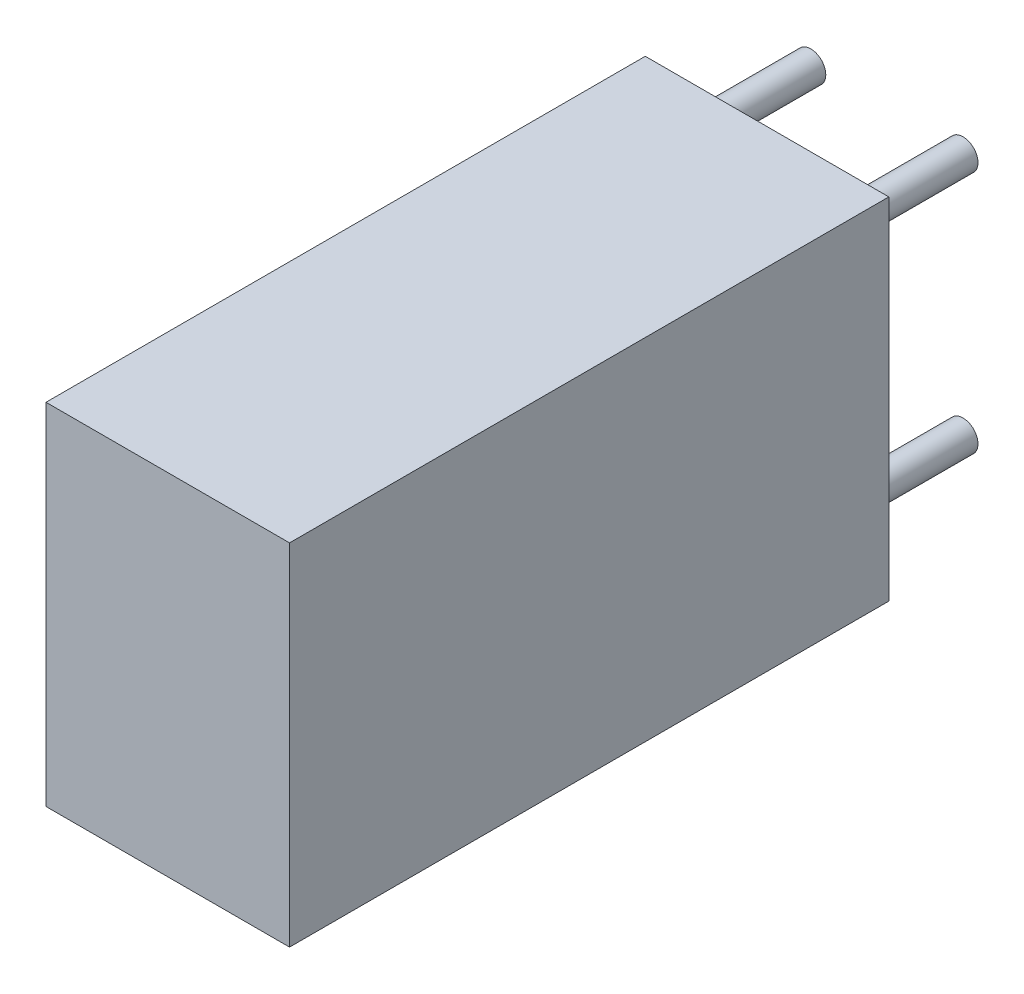
ISO-10303-21;
HEADER;
FILE_DESCRIPTION(('STEP AP214'),'2;1');
FILE_NAME('part.step','',(''),(''),'','','');
FILE_SCHEMA(('AUTOMOTIVE_DESIGN { 1 0 10303 214 1 1 1 1 }'));
ENDSEC;
DATA;
#1=APPLICATION_CONTEXT('core data for automotive mechanical design processes');
#2=APPLICATION_PROTOCOL_DEFINITION('international standard','automotive_design',2000,#1);
#3=PRODUCT_CONTEXT('',#1,'mechanical');
#4=PRODUCT('Part','Part','',(#3));
#5=PRODUCT_RELATED_PRODUCT_CATEGORY('part','',(#4));
#6=PRODUCT_DEFINITION_FORMATION('','',#4);
#7=PRODUCT_DEFINITION_CONTEXT('part definition',#1,'design');
#8=PRODUCT_DEFINITION('design','',#6,#7);
#9=PRODUCT_DEFINITION_SHAPE('','',#8);
#10=(LENGTH_UNIT() NAMED_UNIT(*) SI_UNIT(.MILLI.,.METRE.));
#11=(NAMED_UNIT(*) PLANE_ANGLE_UNIT() SI_UNIT($,.RADIAN.));
#12=(NAMED_UNIT(*) SI_UNIT($,.STERADIAN.) SOLID_ANGLE_UNIT());
#13=UNCERTAINTY_MEASURE_WITH_UNIT(LENGTH_MEASURE(1.E-05),#10,'distance_accuracy_value','');
#14=(GEOMETRIC_REPRESENTATION_CONTEXT(3) GLOBAL_UNCERTAINTY_ASSIGNED_CONTEXT((#13)) GLOBAL_UNIT_ASSIGNED_CONTEXT((#10,
#11,#12)) REPRESENTATION_CONTEXT('',''));
#15=CARTESIAN_POINT('',(0.,0.,0.));
#16=DIRECTION('',(0.,0.,1.));
#17=DIRECTION('',(1.,0.,0.));
#18=AXIS2_PLACEMENT_3D('',#15,#16,#17);
#19=CARTESIAN_POINT('',(0.,0.,-2.));
#20=DIRECTION('',(0.,0.,1.));
#21=DIRECTION('',(1.,0.,0.));
#22=AXIS2_PLACEMENT_3D('',#19,#20,#21);
#23=CYLINDRICAL_SURFACE('',#22,0.25);
#24=CARTESIAN_POINT('',(0.,0.,-2.));
#25=DIRECTION('',(0.,0.,1.));
#26=DIRECTION('',(1.,0.,0.));
#27=AXIS2_PLACEMENT_3D('',#24,#25,#26);
#28=CIRCLE('',#27,0.25);
#29=CARTESIAN_POINT('',(0.25,0.,-2.));
#30=VERTEX_POINT('',#29);
#31=EDGE_CURVE('E11',#30,#30,#28,.T.);
#32=ORIENTED_EDGE('',*,*,#31,.T.);
#33=EDGE_LOOP('',(#32));
#34=FACE_BOUND('',#33,.T.);
#35=CARTESIAN_POINT('',(0.,0.,0.));
#36=DIRECTION('',(0.,0.,1.));
#37=DIRECTION('',(1.,0.,0.));
#38=AXIS2_PLACEMENT_3D('',#35,#36,#37);
#39=CIRCLE('',#38,0.25);
#40=CARTESIAN_POINT('',(0.25,0.,0.));
#41=VERTEX_POINT('',#40);
#42=EDGE_CURVE('E43',#41,#41,#39,.T.);
#43=ORIENTED_EDGE('',*,*,#42,.F.);
#44=EDGE_LOOP('',(#43));
#45=FACE_BOUND('',#44,.T.);
#46=ADVANCED_FACE('F40',(#34,#45),#23,.T.);
#47=CARTESIAN_POINT('',(0.,0.,-2.));
#48=DIRECTION('',(0.,0.,1.));
#49=DIRECTION('',(1.,0.,0.));
#50=AXIS2_PLACEMENT_3D('',#47,#48,#49);
#51=PLANE('',#50);
#52=ORIENTED_EDGE('',*,*,#31,.F.);
#53=EDGE_LOOP('',(#52));
#54=FACE_BOUND('',#53,.T.);
#55=ADVANCED_FACE('F55',(#54),#51,.F.);
#56=CARTESIAN_POINT('',(0.,0.,0.));
#57=DIRECTION('',(0.,0.,1.));
#58=DIRECTION('',(1.,0.,0.));
#59=AXIS2_PLACEMENT_3D('',#56,#57,#58);
#60=PLANE('',#59);
#61=ORIENTED_EDGE('',*,*,#42,.T.);
#62=EDGE_LOOP('',(#61));
#63=FACE_BOUND('',#62,.T.);
#64=ADVANCED_FACE('F52',(#63),#60,.T.);
#65=CLOSED_SHELL('',(#46,#55,#64));
#66=MANIFOLD_SOLID_BREP('B2',#65);
#67=CARTESIAN_POINT('',(2.54,0.,-2.));
#68=DIRECTION('',(0.,0.,1.));
#69=DIRECTION('',(1.,0.,0.));
#70=AXIS2_PLACEMENT_3D('',#67,#68,#69);
#71=CYLINDRICAL_SURFACE('',#70,0.25);
#72=CARTESIAN_POINT('',(2.54,0.,-2.));
#73=DIRECTION('',(0.,0.,1.));
#74=DIRECTION('',(1.,0.,0.));
#75=AXIS2_PLACEMENT_3D('',#72,#73,#74);
#76=CIRCLE('',#75,0.25);
#77=CARTESIAN_POINT('',(2.79,0.,-2.));
#78=VERTEX_POINT('',#77);
#79=EDGE_CURVE('E39',#78,#78,#76,.T.);
#80=ORIENTED_EDGE('',*,*,#79,.T.);
#81=EDGE_LOOP('',(#80));
#82=FACE_BOUND('',#81,.T.);
#83=CARTESIAN_POINT('',(2.54,0.,0.));
#84=DIRECTION('',(0.,0.,1.));
#85=DIRECTION('',(1.,0.,0.));
#86=AXIS2_PLACEMENT_3D('',#83,#84,#85);
#87=CIRCLE('',#86,0.25);
#88=CARTESIAN_POINT('',(2.79,0.,0.));
#89=VERTEX_POINT('',#88);
#90=EDGE_CURVE('E92',#89,#89,#87,.T.);
#91=ORIENTED_EDGE('',*,*,#90,.F.);
#92=EDGE_LOOP('',(#91));
#93=FACE_BOUND('',#92,.T.);
#94=ADVANCED_FACE('F89',(#82,#93),#71,.T.);
#95=CARTESIAN_POINT('',(2.54,0.,-2.));
#96=DIRECTION('',(0.,0.,1.));
#97=DIRECTION('',(1.,0.,0.));
#98=AXIS2_PLACEMENT_3D('',#95,#96,#97);
#99=PLANE('',#98);
#100=ORIENTED_EDGE('',*,*,#79,.F.);
#101=EDGE_LOOP('',(#100));
#102=FACE_BOUND('',#101,.T.);
#103=ADVANCED_FACE('F104',(#102),#99,.F.);
#104=CARTESIAN_POINT('',(2.54,0.,0.));
#105=DIRECTION('',(0.,0.,1.));
#106=DIRECTION('',(1.,0.,0.));
#107=AXIS2_PLACEMENT_3D('',#104,#105,#106);
#108=PLANE('',#107);
#109=ORIENTED_EDGE('',*,*,#90,.T.);
#110=EDGE_LOOP('',(#109));
#111=FACE_BOUND('',#110,.T.);
#112=ADVANCED_FACE('F101',(#111),#108,.T.);
#113=CLOSED_SHELL('',(#94,#103,#112));
#114=MANIFOLD_SOLID_BREP('B6',#113);
#115=CARTESIAN_POINT('',(2.54,4.064,-2.));
#116=DIRECTION('',(0.,0.,1.));
#117=DIRECTION('',(1.,0.,0.));
#118=AXIS2_PLACEMENT_3D('',#115,#116,#117);
#119=CYLINDRICAL_SURFACE('',#118,0.25);
#120=CARTESIAN_POINT('',(2.54,4.064,-2.));
#121=DIRECTION('',(0.,0.,1.));
#122=DIRECTION('',(1.,0.,0.));
#123=AXIS2_PLACEMENT_3D('',#120,#121,#122);
#124=CIRCLE('',#123,0.25);
#125=CARTESIAN_POINT('',(2.79,4.064,-2.));
#126=VERTEX_POINT('',#125);
#127=EDGE_CURVE('E88',#126,#126,#124,.T.);
#128=ORIENTED_EDGE('',*,*,#127,.T.);
#129=EDGE_LOOP('',(#128));
#130=FACE_BOUND('',#129,.T.);
#131=CARTESIAN_POINT('',(2.54,4.064,0.));
#132=DIRECTION('',(0.,0.,1.));
#133=DIRECTION('',(1.,0.,0.));
#134=AXIS2_PLACEMENT_3D('',#131,#132,#133);
#135=CIRCLE('',#134,0.25);
#136=CARTESIAN_POINT('',(2.79,4.064,0.));
#137=VERTEX_POINT('',#136);
#138=EDGE_CURVE('E141',#137,#137,#135,.T.);
#139=ORIENTED_EDGE('',*,*,#138,.F.);
#140=EDGE_LOOP('',(#139));
#141=FACE_BOUND('',#140,.T.);
#142=ADVANCED_FACE('F138',(#130,#141),#119,.T.);
#143=CARTESIAN_POINT('',(2.54,4.064,-2.));
#144=DIRECTION('',(0.,0.,1.));
#145=DIRECTION('',(1.,0.,0.));
#146=AXIS2_PLACEMENT_3D('',#143,#144,#145);
#147=PLANE('',#146);
#148=ORIENTED_EDGE('',*,*,#127,.F.);
#149=EDGE_LOOP('',(#148));
#150=FACE_BOUND('',#149,.T.);
#151=ADVANCED_FACE('F153',(#150),#147,.F.);
#152=CARTESIAN_POINT('',(2.54,4.064,0.));
#153=DIRECTION('',(0.,0.,1.));
#154=DIRECTION('',(1.,0.,0.));
#155=AXIS2_PLACEMENT_3D('',#152,#153,#154);
#156=PLANE('',#155);
#157=ORIENTED_EDGE('',*,*,#138,.T.);
#158=EDGE_LOOP('',(#157));
#159=FACE_BOUND('',#158,.T.);
#160=ADVANCED_FACE('F150',(#159),#156,.T.);
#161=CLOSED_SHELL('',(#142,#151,#160));
#162=MANIFOLD_SOLID_BREP('B34',#161);
#163=CARTESIAN_POINT('',(0.,4.064,-2.));
#164=DIRECTION('',(0.,0.,1.));
#165=DIRECTION('',(1.,0.,0.));
#166=AXIS2_PLACEMENT_3D('',#163,#164,#165);
#167=CYLINDRICAL_SURFACE('',#166,0.25);
#168=CARTESIAN_POINT('',(0.,4.064,-2.));
#169=DIRECTION('',(0.,0.,1.));
#170=DIRECTION('',(1.,0.,0.));
#171=AXIS2_PLACEMENT_3D('',#168,#169,#170);
#172=CIRCLE('',#171,0.25);
#173=CARTESIAN_POINT('',(0.25,4.064,-2.));
#174=VERTEX_POINT('',#173);
#175=EDGE_CURVE('E137',#174,#174,#172,.T.);
#176=ORIENTED_EDGE('',*,*,#175,.T.);
#177=EDGE_LOOP('',(#176));
#178=FACE_BOUND('',#177,.T.);
#179=CARTESIAN_POINT('',(0.,4.064,0.));
#180=DIRECTION('',(0.,0.,1.));
#181=DIRECTION('',(1.,0.,0.));
#182=AXIS2_PLACEMENT_3D('',#179,#180,#181);
#183=CIRCLE('',#182,0.25);
#184=CARTESIAN_POINT('',(0.25,4.064,0.));
#185=VERTEX_POINT('',#184);
#186=EDGE_CURVE('E191',#185,#185,#183,.T.);
#187=ORIENTED_EDGE('',*,*,#186,.F.);
#188=EDGE_LOOP('',(#187));
#189=FACE_BOUND('',#188,.T.);
#190=ADVANCED_FACE('F188',(#178,#189),#167,.T.);
#191=CARTESIAN_POINT('',(0.,4.064,-2.));
#192=DIRECTION('',(0.,0.,1.));
#193=DIRECTION('',(1.,0.,0.));
#194=AXIS2_PLACEMENT_3D('',#191,#192,#193);
#195=PLANE('',#194);
#196=ORIENTED_EDGE('',*,*,#175,.F.);
#197=EDGE_LOOP('',(#196));
#198=FACE_BOUND('',#197,.T.);
#199=ADVANCED_FACE('F203',(#198),#195,.F.);
#200=CARTESIAN_POINT('',(0.,4.064,0.));
#201=DIRECTION('',(0.,0.,1.));
#202=DIRECTION('',(1.,0.,0.));
#203=AXIS2_PLACEMENT_3D('',#200,#201,#202);
#204=PLANE('',#203);
#205=ORIENTED_EDGE('',*,*,#186,.T.);
#206=EDGE_LOOP('',(#205));
#207=FACE_BOUND('',#206,.T.);
#208=ADVANCED_FACE('F200',(#207),#204,.T.);
#209=CLOSED_SHELL('',(#190,#199,#208));
#210=MANIFOLD_SOLID_BREP('B83',#209);
#211=CARTESIAN_POINT('',(3.302,4.826,10.));
#212=DIRECTION('',(0.,-1.,0.));
#213=DIRECTION('',(0.,0.,-1.));
#214=AXIS2_PLACEMENT_3D('',#211,#212,#213);
#215=PLANE('',#214);
#216=DIRECTION('',(-1.,0.,0.));
#217=VECTOR('',#216,1.);
#218=CARTESIAN_POINT('',(3.302,4.826,0.));
#219=LINE('',#218,#217);
#220=CARTESIAN_POINT('',(3.302,4.826,0.));
#221=VERTEX_POINT('',#220);
#222=CARTESIAN_POINT('',(-0.762,4.826,0.));
#223=VERTEX_POINT('',#222);
#224=EDGE_CURVE('E292',#221,#223,#219,.T.);
#225=ORIENTED_EDGE('',*,*,#224,.T.);
#226=DIRECTION('',(0.,0.,-1.));
#227=VECTOR('',#226,1.);
#228=CARTESIAN_POINT('',(-0.762,4.826,10.));
#229=LINE('',#228,#227);
#230=CARTESIAN_POINT('',(-0.762,4.826,10.));
#231=VERTEX_POINT('',#230);
#232=EDGE_CURVE('E186',#231,#223,#229,.T.);
#233=ORIENTED_EDGE('',*,*,#232,.F.);
#234=DIRECTION('',(-1.,0.,0.));
#235=VECTOR('',#234,1.);
#236=CARTESIAN_POINT('',(3.302,4.826,10.));
#237=LINE('',#236,#235);
#238=CARTESIAN_POINT('',(3.302,4.826,10.));
#239=VERTEX_POINT('',#238);
#240=EDGE_CURVE('E280',#239,#231,#237,.T.);
#241=ORIENTED_EDGE('',*,*,#240,.F.);
#242=DIRECTION('',(0.,0.,-1.));
#243=VECTOR('',#242,1.);
#244=CARTESIAN_POINT('',(3.302,4.826,10.));
#245=LINE('',#244,#243);
#246=EDGE_CURVE('E288',#239,#221,#245,.T.);
#247=ORIENTED_EDGE('',*,*,#246,.T.);
#248=EDGE_LOOP('',(#225,#233,#241,#247));
#249=FACE_BOUND('',#248,.T.);
#250=ADVANCED_FACE('F229',(#249),#215,.F.);
#251=CARTESIAN_POINT('',(-0.762,4.826,10.));
#252=DIRECTION('',(1.,0.,0.));
#253=DIRECTION('',(0.,0.,-1.));
#254=AXIS2_PLACEMENT_3D('',#251,#252,#253);
#255=PLANE('',#254);
#256=DIRECTION('',(0.,-1.,0.));
#257=VECTOR('',#256,1.);
#258=CARTESIAN_POINT('',(-0.762,4.826,0.));
#259=LINE('',#258,#257);
#260=CARTESIAN_POINT('',(-0.762,-1.016,0.));
#261=VERTEX_POINT('',#260);
#262=EDGE_CURVE('E284',#223,#261,#259,.T.);
#263=ORIENTED_EDGE('',*,*,#262,.T.);
#264=DIRECTION('',(0.,0.,-1.));
#265=VECTOR('',#264,1.);
#266=CARTESIAN_POINT('',(-0.762,-1.016,10.));
#267=LINE('',#266,#265);
#268=CARTESIAN_POINT('',(-0.762,-1.016,10.));
#269=VERTEX_POINT('',#268);
#270=EDGE_CURVE('E237',#269,#261,#267,.T.);
#271=ORIENTED_EDGE('',*,*,#270,.F.);
#272=DIRECTION('',(0.,-1.,0.));
#273=VECTOR('',#272,1.);
#274=CARTESIAN_POINT('',(-0.762,4.826,10.));
#275=LINE('',#274,#273);
#276=EDGE_CURVE('E275',#231,#269,#275,.T.);
#277=ORIENTED_EDGE('',*,*,#276,.F.);
#278=ORIENTED_EDGE('',*,*,#232,.T.);
#279=EDGE_LOOP('',(#263,#271,#277,#278));
#280=FACE_BOUND('',#279,.T.);
#281=ADVANCED_FACE('F283',(#280),#255,.F.);
#282=CARTESIAN_POINT('',(-0.762,-1.016,10.));
#283=DIRECTION('',(0.,1.,0.));
#284=DIRECTION('',(0.,0.,1.));
#285=AXIS2_PLACEMENT_3D('',#282,#283,#284);
#286=PLANE('',#285);
#287=DIRECTION('',(1.,0.,0.));
#288=VECTOR('',#287,1.);
#289=CARTESIAN_POINT('',(-0.762,-1.016,0.));
#290=LINE('',#289,#288);
#291=CARTESIAN_POINT('',(3.302,-1.016,0.));
#292=VERTEX_POINT('',#291);
#293=EDGE_CURVE('E262',#261,#292,#290,.T.);
#294=ORIENTED_EDGE('',*,*,#293,.T.);
#295=DIRECTION('',(0.,0.,-1.));
#296=VECTOR('',#295,1.);
#297=CARTESIAN_POINT('',(3.302,-1.016,10.));
#298=LINE('',#297,#296);
#299=CARTESIAN_POINT('',(3.302,-1.016,10.));
#300=VERTEX_POINT('',#299);
#301=EDGE_CURVE('E285',#300,#292,#298,.T.);
#302=ORIENTED_EDGE('',*,*,#301,.F.);
#303=DIRECTION('',(1.,0.,0.));
#304=VECTOR('',#303,1.);
#305=CARTESIAN_POINT('',(-0.762,-1.016,10.));
#306=LINE('',#305,#304);
#307=EDGE_CURVE('E278',#269,#300,#306,.T.);
#308=ORIENTED_EDGE('',*,*,#307,.F.);
#309=ORIENTED_EDGE('',*,*,#270,.T.);
#310=EDGE_LOOP('',(#294,#302,#308,#309));
#311=FACE_BOUND('',#310,.T.);
#312=ADVANCED_FACE('F286',(#311),#286,.F.);
#313=CARTESIAN_POINT('',(3.302,-1.016,10.));
#314=DIRECTION('',(-1.,0.,0.));
#315=DIRECTION('',(0.,0.,1.));
#316=AXIS2_PLACEMENT_3D('',#313,#314,#315);
#317=PLANE('',#316);
#318=DIRECTION('',(0.,1.,0.));
#319=VECTOR('',#318,1.);
#320=CARTESIAN_POINT('',(3.302,-1.016,0.));
#321=LINE('',#320,#319);
#322=EDGE_CURVE('E268',#292,#221,#321,.T.);
#323=ORIENTED_EDGE('',*,*,#322,.T.);
#324=ORIENTED_EDGE('',*,*,#246,.F.);
#325=DIRECTION('',(0.,1.,0.));
#326=VECTOR('',#325,1.);
#327=CARTESIAN_POINT('',(3.302,-1.016,10.));
#328=LINE('',#327,#326);
#329=EDGE_CURVE('E245',#300,#239,#328,.T.);
#330=ORIENTED_EDGE('',*,*,#329,.F.);
#331=ORIENTED_EDGE('',*,*,#301,.T.);
#332=EDGE_LOOP('',(#323,#324,#330,#331));
#333=FACE_BOUND('',#332,.T.);
#334=ADVANCED_FACE('F299',(#333),#317,.F.);
#335=CARTESIAN_POINT('',(0.,0.,10.));
#336=DIRECTION('',(0.,0.,1.));
#337=DIRECTION('',(1.,0.,0.));
#338=AXIS2_PLACEMENT_3D('',#335,#336,#337);
#339=PLANE('',#338);
#340=ORIENTED_EDGE('',*,*,#240,.T.);
#341=ORIENTED_EDGE('',*,*,#276,.T.);
#342=ORIENTED_EDGE('',*,*,#307,.T.);
#343=ORIENTED_EDGE('',*,*,#329,.T.);
#344=EDGE_LOOP('',(#340,#341,#342,#343));
#345=FACE_BOUND('',#344,.T.);
#346=ADVANCED_FACE('F276',(#345),#339,.T.);
#347=CARTESIAN_POINT('',(0.,0.,0.));
#348=DIRECTION('',(0.,0.,1.));
#349=DIRECTION('',(1.,0.,0.));
#350=AXIS2_PLACEMENT_3D('',#347,#348,#349);
#351=PLANE('',#350);
#352=ORIENTED_EDGE('',*,*,#224,.F.);
#353=ORIENTED_EDGE('',*,*,#322,.F.);
#354=ORIENTED_EDGE('',*,*,#293,.F.);
#355=ORIENTED_EDGE('',*,*,#262,.F.);
#356=EDGE_LOOP('',(#352,#353,#354,#355));
#357=FACE_BOUND('',#356,.T.);
#358=ADVANCED_FACE('F302',(#357),#351,.F.);
#359=CLOSED_SHELL('',(#250,#281,#312,#334,#346,#358));
#360=MANIFOLD_SOLID_BREP('B132',#359);
#361=ADVANCED_BREP_SHAPE_REPRESENTATION('',(#18,#66,#114,#162,#210,#360),#14);
#362=SHAPE_DEFINITION_REPRESENTATION(#9,#361);
ENDSEC;
END-ISO-10303-21;
